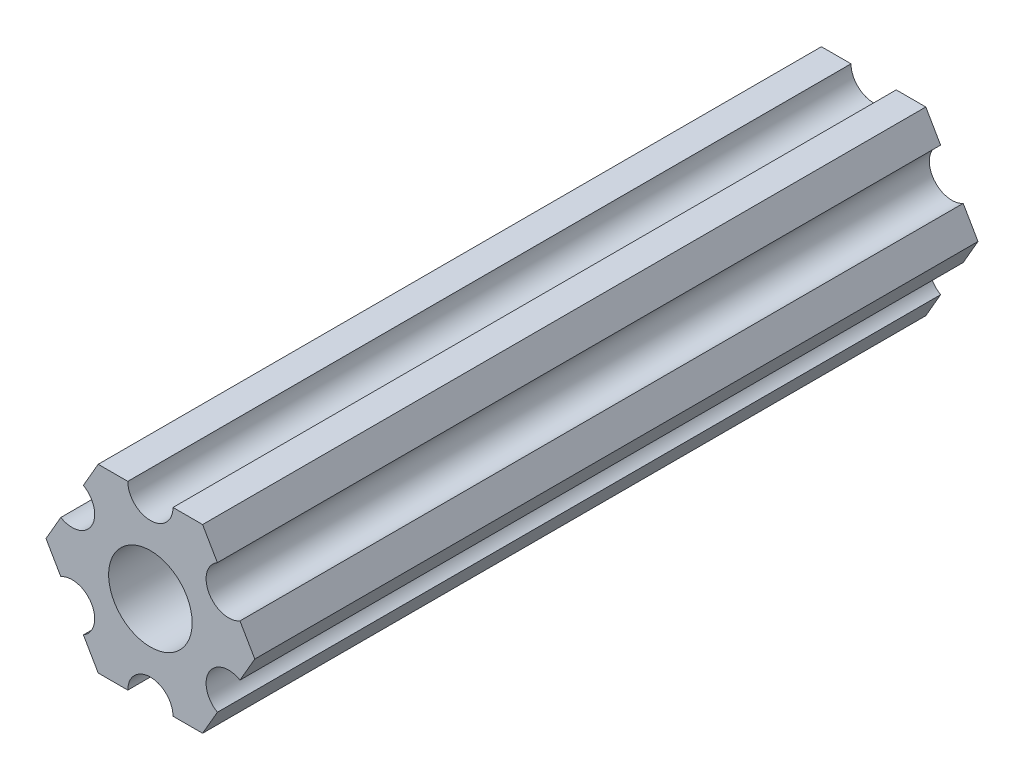
ISO-10303-21;
HEADER;
FILE_DESCRIPTION(('STEP AP214'),'2;1');
FILE_NAME('part.step','',(''),(''),'','','');
FILE_SCHEMA(('AUTOMOTIVE_DESIGN { 1 0 10303 214 1 1 1 1 }'));
ENDSEC;
DATA;
#1=APPLICATION_CONTEXT('core data for automotive mechanical design processes');
#2=APPLICATION_PROTOCOL_DEFINITION('international standard','automotive_design',2000,#1);
#3=PRODUCT_CONTEXT('',#1,'mechanical');
#4=PRODUCT('Part','Part','',(#3));
#5=PRODUCT_RELATED_PRODUCT_CATEGORY('part','',(#4));
#6=PRODUCT_DEFINITION_FORMATION('','',#4);
#7=PRODUCT_DEFINITION_CONTEXT('part definition',#1,'design');
#8=PRODUCT_DEFINITION('design','',#6,#7);
#9=PRODUCT_DEFINITION_SHAPE('','',#8);
#10=(LENGTH_UNIT() NAMED_UNIT(*) SI_UNIT(.MILLI.,.METRE.));
#11=(NAMED_UNIT(*) PLANE_ANGLE_UNIT() SI_UNIT($,.RADIAN.));
#12=(NAMED_UNIT(*) SI_UNIT($,.STERADIAN.) SOLID_ANGLE_UNIT());
#13=UNCERTAINTY_MEASURE_WITH_UNIT(LENGTH_MEASURE(1.E-05),#10,'distance_accuracy_value','');
#14=(GEOMETRIC_REPRESENTATION_CONTEXT(3) GLOBAL_UNCERTAINTY_ASSIGNED_CONTEXT((#13)) GLOBAL_UNIT_ASSIGNED_CONTEXT((#10,
#11,#12)) REPRESENTATION_CONTEXT('',''));
#15=CARTESIAN_POINT('',(0.,0.,0.));
#16=DIRECTION('',(0.,0.,1.));
#17=DIRECTION('',(1.,0.,0.));
#18=AXIS2_PLACEMENT_3D('',#15,#16,#17);
#19=CARTESIAN_POINT('',(5.49926150638083,-3.17499966684068,-50.8));
#20=DIRECTION('',(0.,0.,1.));
#21=DIRECTION('',(1.,0.,0.));
#22=AXIS2_PLACEMENT_3D('',#19,#20,#21);
#23=PLANE('',#22);
#24=CARTESIAN_POINT('',(5.49926150638083,-3.17499966684068,-50.8));
#25=DIRECTION('',(0.,0.,1.));
#26=DIRECTION('',(1.,0.,0.));
#27=AXIS2_PLACEMENT_3D('',#24,#25,#26);
#28=CIRCLE('',#27,1.58750000000001);
#29=CARTESIAN_POINT('',(6.29301142309098,-1.80018429024546,-50.8));
#30=VERTEX_POINT('',#29);
#31=CARTESIAN_POINT('',(4.70551158967068,-4.54981504343589,-50.8));
#32=VERTEX_POINT('',#31);
#33=EDGE_CURVE('E224',#30,#32,#28,.T.);
#34=ORIENTED_EDGE('',*,*,#33,.T.);
#35=DIRECTION('',(-0.499999947533953,-0.866025434075723,0.));
#36=VECTOR('',#35,1.);
#37=CARTESIAN_POINT('',(4.70551158967068,-4.54981504343589,-50.8));
#38=LINE('',#37,#36);
#39=CARTESIAN_POINT('',(3.66617452134693,-6.34999990382519,-50.8));
#40=VERTEX_POINT('',#39);
#41=EDGE_CURVE('E122',#32,#40,#38,.T.);
#42=ORIENTED_EDGE('',*,*,#41,.T.);
#43=DIRECTION('',(-1.,0.,0.));
#44=VECTOR('',#43,1.);
#45=CARTESIAN_POINT('',(3.66617452134693,-6.34999990382519,-50.8));
#46=LINE('',#45,#44);
#47=CARTESIAN_POINT('',(1.58750038469926,-6.34999990382518,-50.8));
#48=VERTEX_POINT('',#47);
#49=EDGE_CURVE('E269',#40,#48,#46,.T.);
#50=ORIENTED_EDGE('',*,*,#49,.T.);
#51=CARTESIAN_POINT('',(3.8469926204343E-07,-6.34999990382519,-50.8));
#52=DIRECTION('',(0.,0.,1.));
#53=DIRECTION('',(1.,0.,0.));
#54=AXIS2_PLACEMENT_3D('',#51,#52,#53);
#55=CIRCLE('',#54,1.5875);
#56=CARTESIAN_POINT('',(-1.58749961530074,-6.34999990382519,-50.8));
#57=VERTEX_POINT('',#56);
#58=EDGE_CURVE('E288',#48,#57,#55,.T.);
#59=ORIENTED_EDGE('',*,*,#58,.T.);
#60=DIRECTION('',(-1.,0.,0.));
#61=VECTOR('',#60,1.);
#62=CARTESIAN_POINT('',(-1.58749961530074,-6.34999990382519,-50.8));
#63=LINE('',#62,#61);
#64=CARTESIAN_POINT('',(-3.66617382465481,-6.34999990382519,-50.8));
#65=VERTEX_POINT('',#64);
#66=EDGE_CURVE('E285',#57,#65,#63,.T.);
#67=ORIENTED_EDGE('',*,*,#66,.T.);
#68=DIRECTION('',(-0.5,0.866025403784439,0.));
#69=VECTOR('',#68,1.);
#70=CARTESIAN_POINT('',(-3.66617382465481,-6.34999990382519,-50.8));
#71=LINE('',#70,#69);
#72=CARTESIAN_POINT('',(-4.70551092933191,-4.54981523233291,-50.8));
#73=VERTEX_POINT('',#72);
#74=EDGE_CURVE('E287',#65,#73,#71,.T.);
#75=ORIENTED_EDGE('',*,*,#74,.T.);
#76=CARTESIAN_POINT('',(-5.49926092933191,-3.17499990382512,-50.8));
#77=DIRECTION('',(0.,0.,1.));
#78=DIRECTION('',(1.,0.,0.));
#79=AXIS2_PLACEMENT_3D('',#76,#77,#78);
#80=CIRCLE('',#79,1.5875);
#81=CARTESIAN_POINT('',(-6.29301092933191,-1.80018457531732,-50.8));
#82=VERTEX_POINT('',#81);
#83=EDGE_CURVE('E290',#73,#82,#80,.T.);
#84=ORIENTED_EDGE('',*,*,#83,.T.);
#85=DIRECTION('',(-0.5,0.866025403784438,0.));
#86=VECTOR('',#85,1.);
#87=CARTESIAN_POINT('',(-6.29301092933191,-1.80018457531732,-50.8));
#88=LINE('',#87,#86);
#89=CARTESIAN_POINT('',(-7.33234803400895,9.61748368946088E-08,-50.8));
#90=VERTEX_POINT('',#89);
#91=EDGE_CURVE('E296',#82,#90,#88,.T.);
#92=ORIENTED_EDGE('',*,*,#91,.T.);
#93=DIRECTION('',(0.499999921300922,0.866025449221368,0.));
#94=VECTOR('',#93,1.);
#95=CARTESIAN_POINT('',(-7.33234803400895,9.61748368946088E-08,-50.8));
#96=LINE('',#95,#94);
#97=CARTESIAN_POINT('',(-6.29301117773375,1.80018471521667,-50.8));
#98=VERTEX_POINT('',#97);
#99=EDGE_CURVE('E298',#90,#98,#96,.T.);
#100=ORIENTED_EDGE('',*,*,#99,.T.);
#101=CARTESIAN_POINT('',(-5.49926130266854,3.1750001158556,-50.8));
#102=DIRECTION('',(0.,0.,1.));
#103=DIRECTION('',(1.,0.,0.));
#104=AXIS2_PLACEMENT_3D('',#101,#102,#103);
#105=CIRCLE('',#104,1.5875);
#106=CARTESIAN_POINT('',(-4.70551142760333,4.54981551649452,-50.8));
#107=VERTEX_POINT('',#106);
#108=EDGE_CURVE('E300',#98,#107,#105,.T.);
#109=ORIENTED_EDGE('',*,*,#108,.T.);
#110=DIRECTION('',(0.499999921300922,0.866025449221368,0.));
#111=VECTOR('',#110,1.);
#112=CARTESIAN_POINT('',(-4.70551142760333,4.54981551649452,-50.8));
#113=LINE('',#112,#111);
#114=CARTESIAN_POINT('',(-3.66617452134701,6.35000022210623,-50.8));
#115=VERTEX_POINT('',#114);
#116=EDGE_CURVE('E302',#107,#115,#113,.T.);
#117=ORIENTED_EDGE('',*,*,#116,.T.);
#118=DIRECTION('',(1.,0.,0.));
#119=VECTOR('',#118,1.);
#120=CARTESIAN_POINT('',(-3.66617452134701,6.35000022210623,-50.8));
#121=LINE('',#120,#119);
#122=CARTESIAN_POINT('',(-1.58750038469935,6.35000022210623,-50.8));
#123=VERTEX_POINT('',#122);
#124=EDGE_CURVE('E304',#115,#123,#121,.T.);
#125=ORIENTED_EDGE('',*,*,#124,.T.);
#126=CARTESIAN_POINT('',(-3.84699344941095E-07,6.35000022210623,-50.8));
#127=DIRECTION('',(0.,0.,1.));
#128=DIRECTION('',(1.,0.,0.));
#129=AXIS2_PLACEMENT_3D('',#126,#127,#128);
#130=CIRCLE('',#129,1.5875);
#131=CARTESIAN_POINT('',(1.58749961530066,6.35000022210623,-50.8));
#132=VERTEX_POINT('',#131);
#133=EDGE_CURVE('E306',#123,#132,#130,.T.);
#134=ORIENTED_EDGE('',*,*,#133,.T.);
#135=DIRECTION('',(1.,0.,0.));
#136=VECTOR('',#135,1.);
#137=CARTESIAN_POINT('',(1.58749961530066,6.35000022210623,-50.8));
#138=LINE('',#137,#136);
#139=CARTESIAN_POINT('',(3.66617382465472,6.35000022210622,-50.8));
#140=VERTEX_POINT('',#139);
#141=EDGE_CURVE('E308',#132,#140,#138,.T.);
#142=ORIENTED_EDGE('',*,*,#141,.T.);
#143=DIRECTION('',(0.500000052466056,-0.866025373493145,0.));
#144=VECTOR('',#143,1.);
#145=CARTESIAN_POINT('',(3.66617382465472,6.35000022210622,-50.8));
#146=LINE('',#145,#144);
#147=CARTESIAN_POINT('',(4.70551103839166,4.54981561357968,-50.8));
#148=VERTEX_POINT('',#147);
#149=EDGE_CURVE('E171',#140,#148,#146,.T.);
#150=ORIENTED_EDGE('',*,*,#149,.T.);
#151=CARTESIAN_POINT('',(5.49926112168152,3.17500033315931,-50.8));
#152=DIRECTION('',(0.,0.,1.));
#153=DIRECTION('',(1.,0.,0.));
#154=AXIS2_PLACEMENT_3D('',#151,#152,#153);
#155=CIRCLE('',#154,1.5875);
#156=CARTESIAN_POINT('',(6.29301120497139,1.80018505273895,-50.8));
#157=VERTEX_POINT('',#156);
#158=EDGE_CURVE('E165',#148,#157,#155,.T.);
#159=ORIENTED_EDGE('',*,*,#158,.T.);
#160=DIRECTION('',(0.500000052466056,-0.866025373493145,0.));
#161=VECTOR('',#160,1.);
#162=CARTESIAN_POINT('',(6.29301120497139,1.80018505273895,-50.8));
#163=LINE('',#162,#161);
#164=CARTESIAN_POINT('',(7.33234841870826,4.44212518856872E-07,-50.8));
#165=VERTEX_POINT('',#164);
#166=EDGE_CURVE('E169',#157,#165,#163,.T.);
#167=ORIENTED_EDGE('',*,*,#166,.T.);
#168=DIRECTION('',(-0.499999947533953,-0.866025434075723,0.));
#169=VECTOR('',#168,1.);
#170=CARTESIAN_POINT('',(7.33234841870826,4.44212518856872E-07,-50.8));
#171=LINE('',#170,#169);
#172=EDGE_CURVE('E49',#165,#30,#171,.T.);
#173=ORIENTED_EDGE('',*,*,#172,.T.);
#174=EDGE_LOOP('',(#34,#42,#50,#59,#67,#75,#84,#92,#100,#109,#117,#125,#134,#142,#150,#159,#167,#173));
#175=FACE_BOUND('',#174,.T.);
#176=CARTESIAN_POINT('',(0.,0.,-50.8));
#177=DIRECTION('',(0.,0.,-1.));
#178=DIRECTION('',(1.,0.,0.));
#179=AXIS2_PLACEMENT_3D('',#176,#177,#178);
#180=CIRCLE('',#179,2.9337);
#181=CARTESIAN_POINT('',(2.9337,0.,-50.8));
#182=VERTEX_POINT('',#181);
#183=EDGE_CURVE('E193',#182,#182,#180,.T.);
#184=ORIENTED_EDGE('',*,*,#183,.F.);
#185=EDGE_LOOP('',(#184));
#186=FACE_BOUND('',#185,.T.);
#187=ADVANCED_FACE('F32',(#175,#186),#23,.F.);
#188=CARTESIAN_POINT('',(5.49926150638083,-3.17499966684068,0.));
#189=DIRECTION('',(0.,0.,1.));
#190=DIRECTION('',(1.,0.,0.));
#191=AXIS2_PLACEMENT_3D('',#188,#189,#190);
#192=PLANE('',#191);
#193=CARTESIAN_POINT('',(5.49926150638083,-3.17499966684068,0.));
#194=DIRECTION('',(0.,0.,1.));
#195=DIRECTION('',(1.,0.,0.));
#196=AXIS2_PLACEMENT_3D('',#193,#194,#195);
#197=CIRCLE('',#196,1.58750000000001);
#198=CARTESIAN_POINT('',(6.29301142309098,-1.80018429024546,0.));
#199=VERTEX_POINT('',#198);
#200=CARTESIAN_POINT('',(4.70551158967068,-4.54981504343589,0.));
#201=VERTEX_POINT('',#200);
#202=EDGE_CURVE('E189',#199,#201,#197,.T.);
#203=ORIENTED_EDGE('',*,*,#202,.F.);
#204=DIRECTION('',(-0.499999947533953,-0.866025434075723,0.));
#205=VECTOR('',#204,1.);
#206=CARTESIAN_POINT('',(7.33234841870826,4.44212518856872E-07,0.));
#207=LINE('',#206,#205);
#208=CARTESIAN_POINT('',(7.33234841870826,4.44212518856872E-07,0.));
#209=VERTEX_POINT('',#208);
#210=EDGE_CURVE('E114',#209,#199,#207,.T.);
#211=ORIENTED_EDGE('',*,*,#210,.F.);
#212=DIRECTION('',(0.500000052466056,-0.866025373493145,0.));
#213=VECTOR('',#212,1.);
#214=CARTESIAN_POINT('',(6.29301120497139,1.80018505273895,0.));
#215=LINE('',#214,#213);
#216=CARTESIAN_POINT('',(6.29301120497139,1.80018505273895,0.));
#217=VERTEX_POINT('',#216);
#218=EDGE_CURVE('E108',#217,#209,#215,.T.);
#219=ORIENTED_EDGE('',*,*,#218,.F.);
#220=CARTESIAN_POINT('',(5.49926112168152,3.17500033315931,0.));
#221=DIRECTION('',(0.,0.,1.));
#222=DIRECTION('',(1.,0.,0.));
#223=AXIS2_PLACEMENT_3D('',#220,#221,#222);
#224=CIRCLE('',#223,1.5875);
#225=CARTESIAN_POINT('',(4.70551103839166,4.54981561357968,0.));
#226=VERTEX_POINT('',#225);
#227=EDGE_CURVE('E179',#226,#217,#224,.T.);
#228=ORIENTED_EDGE('',*,*,#227,.F.);
#229=DIRECTION('',(0.500000052466056,-0.866025373493145,0.));
#230=VECTOR('',#229,1.);
#231=CARTESIAN_POINT('',(3.66617382465472,6.35000022210622,0.));
#232=LINE('',#231,#230);
#233=CARTESIAN_POINT('',(3.66617382465472,6.35000022210622,0.));
#234=VERTEX_POINT('',#233);
#235=EDGE_CURVE('E219',#234,#226,#232,.T.);
#236=ORIENTED_EDGE('',*,*,#235,.F.);
#237=DIRECTION('',(1.,0.,0.));
#238=VECTOR('',#237,1.);
#239=CARTESIAN_POINT('',(1.58749961530066,6.35000022210623,0.));
#240=LINE('',#239,#238);
#241=CARTESIAN_POINT('',(1.58749961530066,6.35000022210623,0.));
#242=VERTEX_POINT('',#241);
#243=EDGE_CURVE('E217',#242,#234,#240,.T.);
#244=ORIENTED_EDGE('',*,*,#243,.F.);
#245=CARTESIAN_POINT('',(-3.84699344941095E-07,6.35000022210623,0.));
#246=DIRECTION('',(0.,0.,1.));
#247=DIRECTION('',(1.,0.,0.));
#248=AXIS2_PLACEMENT_3D('',#245,#246,#247);
#249=CIRCLE('',#248,1.5875);
#250=CARTESIAN_POINT('',(-1.58750038469935,6.35000022210623,0.));
#251=VERTEX_POINT('',#250);
#252=EDGE_CURVE('E215',#251,#242,#249,.T.);
#253=ORIENTED_EDGE('',*,*,#252,.F.);
#254=DIRECTION('',(1.,0.,0.));
#255=VECTOR('',#254,1.);
#256=CARTESIAN_POINT('',(-3.66617452134701,6.35000022210623,0.));
#257=LINE('',#256,#255);
#258=CARTESIAN_POINT('',(-3.66617452134701,6.35000022210623,0.));
#259=VERTEX_POINT('',#258);
#260=EDGE_CURVE('E213',#259,#251,#257,.T.);
#261=ORIENTED_EDGE('',*,*,#260,.F.);
#262=DIRECTION('',(0.499999921300922,0.866025449221368,0.));
#263=VECTOR('',#262,1.);
#264=CARTESIAN_POINT('',(-4.70551142760333,4.54981551649452,0.));
#265=LINE('',#264,#263);
#266=CARTESIAN_POINT('',(-4.70551142760333,4.54981551649452,0.));
#267=VERTEX_POINT('',#266);
#268=EDGE_CURVE('E211',#267,#259,#265,.T.);
#269=ORIENTED_EDGE('',*,*,#268,.F.);
#270=CARTESIAN_POINT('',(-5.49926130266854,3.1750001158556,0.));
#271=DIRECTION('',(0.,0.,1.));
#272=DIRECTION('',(1.,0.,0.));
#273=AXIS2_PLACEMENT_3D('',#270,#271,#272);
#274=CIRCLE('',#273,1.5875);
#275=CARTESIAN_POINT('',(-6.29301117773375,1.80018471521667,0.));
#276=VERTEX_POINT('',#275);
#277=EDGE_CURVE('E209',#276,#267,#274,.T.);
#278=ORIENTED_EDGE('',*,*,#277,.F.);
#279=DIRECTION('',(0.499999921300922,0.866025449221368,0.));
#280=VECTOR('',#279,1.);
#281=CARTESIAN_POINT('',(-7.33234803400895,9.61748368946088E-08,0.));
#282=LINE('',#281,#280);
#283=CARTESIAN_POINT('',(-7.33234803400895,9.61748368946088E-08,0.));
#284=VERTEX_POINT('',#283);
#285=EDGE_CURVE('E207',#284,#276,#282,.T.);
#286=ORIENTED_EDGE('',*,*,#285,.F.);
#287=DIRECTION('',(-0.5,0.866025403784438,0.));
#288=VECTOR('',#287,1.);
#289=CARTESIAN_POINT('',(-6.29301092933191,-1.80018457531732,0.));
#290=LINE('',#289,#288);
#291=CARTESIAN_POINT('',(-6.29301092933191,-1.80018457531732,0.));
#292=VERTEX_POINT('',#291);
#293=EDGE_CURVE('E205',#292,#284,#290,.T.);
#294=ORIENTED_EDGE('',*,*,#293,.F.);
#295=CARTESIAN_POINT('',(-5.49926092933191,-3.17499990382512,0.));
#296=DIRECTION('',(0.,0.,1.));
#297=DIRECTION('',(1.,0.,0.));
#298=AXIS2_PLACEMENT_3D('',#295,#296,#297);
#299=CIRCLE('',#298,1.5875);
#300=CARTESIAN_POINT('',(-4.70551092933191,-4.54981523233291,0.));
#301=VERTEX_POINT('',#300);
#302=EDGE_CURVE('E203',#301,#292,#299,.T.);
#303=ORIENTED_EDGE('',*,*,#302,.F.);
#304=DIRECTION('',(-0.5,0.866025403784439,0.));
#305=VECTOR('',#304,1.);
#306=CARTESIAN_POINT('',(-3.66617382465481,-6.34999990382519,0.));
#307=LINE('',#306,#305);
#308=CARTESIAN_POINT('',(-3.66617382465481,-6.34999990382519,0.));
#309=VERTEX_POINT('',#308);
#310=EDGE_CURVE('E201',#309,#301,#307,.T.);
#311=ORIENTED_EDGE('',*,*,#310,.F.);
#312=DIRECTION('',(-1.,0.,0.));
#313=VECTOR('',#312,1.);
#314=CARTESIAN_POINT('',(-1.58749961530074,-6.34999990382519,0.));
#315=LINE('',#314,#313);
#316=CARTESIAN_POINT('',(-1.58749961530074,-6.34999990382519,0.));
#317=VERTEX_POINT('',#316);
#318=EDGE_CURVE('E199',#317,#309,#315,.T.);
#319=ORIENTED_EDGE('',*,*,#318,.F.);
#320=CARTESIAN_POINT('',(3.8469926204343E-07,-6.34999990382519,0.));
#321=DIRECTION('',(0.,0.,1.));
#322=DIRECTION('',(1.,0.,0.));
#323=AXIS2_PLACEMENT_3D('',#320,#321,#322);
#324=CIRCLE('',#323,1.5875);
#325=CARTESIAN_POINT('',(1.58750038469926,-6.34999990382518,0.));
#326=VERTEX_POINT('',#325);
#327=EDGE_CURVE('E197',#326,#317,#324,.T.);
#328=ORIENTED_EDGE('',*,*,#327,.F.);
#329=DIRECTION('',(-1.,0.,0.));
#330=VECTOR('',#329,1.);
#331=CARTESIAN_POINT('',(3.66617452134693,-6.34999990382519,0.));
#332=LINE('',#331,#330);
#333=CARTESIAN_POINT('',(3.66617452134693,-6.34999990382519,0.));
#334=VERTEX_POINT('',#333);
#335=EDGE_CURVE('E195',#334,#326,#332,.T.);
#336=ORIENTED_EDGE('',*,*,#335,.F.);
#337=DIRECTION('',(-0.499999947533953,-0.866025434075723,0.));
#338=VECTOR('',#337,1.);
#339=CARTESIAN_POINT('',(4.70551158967068,-4.54981504343589,0.));
#340=LINE('',#339,#338);
#341=EDGE_CURVE('E192',#201,#334,#340,.T.);
#342=ORIENTED_EDGE('',*,*,#341,.F.);
#343=EDGE_LOOP('',(#203,#211,#219,#228,#236,#244,#253,#261,#269,#278,#286,#294,#303,#311,#319,
#328,#336,#342));
#344=FACE_BOUND('',#343,.T.);
#345=CARTESIAN_POINT('',(0.,0.,0.));
#346=DIRECTION('',(0.,0.,-1.));
#347=DIRECTION('',(1.,0.,0.));
#348=AXIS2_PLACEMENT_3D('',#345,#346,#347);
#349=CIRCLE('',#348,2.9337);
#350=CARTESIAN_POINT('',(2.9337,0.,0.));
#351=VERTEX_POINT('',#350);
#352=EDGE_CURVE('E533',#351,#351,#349,.T.);
#353=ORIENTED_EDGE('',*,*,#352,.T.);
#354=EDGE_LOOP('',(#353));
#355=FACE_BOUND('',#354,.T.);
#356=ADVANCED_FACE('F273',(#344,#355),#192,.T.);
#357=CARTESIAN_POINT('',(5.49926150638083,-3.17499966684068,-50.8));
#358=DIRECTION('',(0.,0.,1.));
#359=DIRECTION('',(1.,0.,0.));
#360=AXIS2_PLACEMENT_3D('',#357,#358,#359);
#361=CYLINDRICAL_SURFACE('',#360,1.58750000000001);
#362=ORIENTED_EDGE('',*,*,#202,.T.);
#363=DIRECTION('',(0.,0.,1.));
#364=VECTOR('',#363,1.);
#365=CARTESIAN_POINT('',(4.70551158967068,-4.54981504343589,-50.8));
#366=LINE('',#365,#364);
#367=EDGE_CURVE('E11',#32,#201,#366,.T.);
#368=ORIENTED_EDGE('',*,*,#367,.F.);
#369=ORIENTED_EDGE('',*,*,#33,.F.);
#370=DIRECTION('',(0.,0.,1.));
#371=VECTOR('',#370,1.);
#372=CARTESIAN_POINT('',(6.29301142309098,-1.80018429024546,-50.8));
#373=LINE('',#372,#371);
#374=EDGE_CURVE('E185',#30,#199,#373,.T.);
#375=ORIENTED_EDGE('',*,*,#374,.T.);
#376=EDGE_LOOP('',(#362,#368,#369,#375));
#377=FACE_BOUND('',#376,.T.);
#378=ADVANCED_FACE('F34',(#377),#361,.F.);
#379=CARTESIAN_POINT('',(4.70551158967068,-4.54981504343589,-50.8));
#380=DIRECTION('',(-0.866025434075723,0.499999947533953,0.));
#381=DIRECTION('',(-0.499999947533953,-0.866025434075723,0.));
#382=AXIS2_PLACEMENT_3D('',#379,#380,#381);
#383=PLANE('',#382);
#384=ORIENTED_EDGE('',*,*,#341,.T.);
#385=DIRECTION('',(0.,0.,1.));
#386=VECTOR('',#385,1.);
#387=CARTESIAN_POINT('',(3.66617452134693,-6.34999990382519,-50.8));
#388=LINE('',#387,#386);
#389=EDGE_CURVE('E41',#40,#334,#388,.T.);
#390=ORIENTED_EDGE('',*,*,#389,.F.);
#391=ORIENTED_EDGE('',*,*,#41,.F.);
#392=ORIENTED_EDGE('',*,*,#367,.T.);
#393=EDGE_LOOP('',(#384,#390,#391,#392));
#394=FACE_BOUND('',#393,.T.);
#395=ADVANCED_FACE('F342',(#394),#383,.F.);
#396=CARTESIAN_POINT('',(3.66617452134693,-6.34999990382519,-50.8));
#397=DIRECTION('',(0.,1.,0.));
#398=DIRECTION('',(-1.,0.,0.));
#399=AXIS2_PLACEMENT_3D('',#396,#397,#398);
#400=PLANE('',#399);
#401=ORIENTED_EDGE('',*,*,#335,.T.);
#402=DIRECTION('',(0.,0.,1.));
#403=VECTOR('',#402,1.);
#404=CARTESIAN_POINT('',(1.58750038469926,-6.34999990382518,-50.8));
#405=LINE('',#404,#403);
#406=EDGE_CURVE('E261',#48,#326,#405,.T.);
#407=ORIENTED_EDGE('',*,*,#406,.F.);
#408=ORIENTED_EDGE('',*,*,#49,.F.);
#409=ORIENTED_EDGE('',*,*,#389,.T.);
#410=EDGE_LOOP('',(#401,#407,#408,#409));
#411=FACE_BOUND('',#410,.T.);
#412=ADVANCED_FACE('F267',(#411),#400,.F.);
#413=CARTESIAN_POINT('',(3.8469926204343E-07,-6.34999990382519,-50.8));
#414=DIRECTION('',(0.,0.,1.));
#415=DIRECTION('',(1.,0.,0.));
#416=AXIS2_PLACEMENT_3D('',#413,#414,#415);
#417=CYLINDRICAL_SURFACE('',#416,1.5875);
#418=ORIENTED_EDGE('',*,*,#327,.T.);
#419=DIRECTION('',(0.,0.,1.));
#420=VECTOR('',#419,1.);
#421=CARTESIAN_POINT('',(-1.58749961530074,-6.34999990382519,-50.8));
#422=LINE('',#421,#420);
#423=EDGE_CURVE('E258',#57,#317,#422,.T.);
#424=ORIENTED_EDGE('',*,*,#423,.F.);
#425=ORIENTED_EDGE('',*,*,#58,.F.);
#426=ORIENTED_EDGE('',*,*,#406,.T.);
#427=EDGE_LOOP('',(#418,#424,#425,#426));
#428=FACE_BOUND('',#427,.T.);
#429=ADVANCED_FACE('F279',(#428),#417,.F.);
#430=CARTESIAN_POINT('',(-1.58749961530074,-6.34999990382519,-50.8));
#431=DIRECTION('',(0.,1.,0.));
#432=DIRECTION('',(-1.,0.,0.));
#433=AXIS2_PLACEMENT_3D('',#430,#431,#432);
#434=PLANE('',#433);
#435=ORIENTED_EDGE('',*,*,#318,.T.);
#436=DIRECTION('',(0.,0.,1.));
#437=VECTOR('',#436,1.);
#438=CARTESIAN_POINT('',(-3.66617382465481,-6.34999990382519,-50.8));
#439=LINE('',#438,#437);
#440=EDGE_CURVE('E255',#65,#309,#439,.T.);
#441=ORIENTED_EDGE('',*,*,#440,.F.);
#442=ORIENTED_EDGE('',*,*,#66,.F.);
#443=ORIENTED_EDGE('',*,*,#423,.T.);
#444=EDGE_LOOP('',(#435,#441,#442,#443));
#445=FACE_BOUND('',#444,.T.);
#446=ADVANCED_FACE('F283',(#445),#434,.F.);
#447=CARTESIAN_POINT('',(-3.66617382465481,-6.34999990382519,-50.8));
#448=DIRECTION('',(0.866025403784438,0.5,0.));
#449=DIRECTION('',(-0.5,0.866025403784439,0.));
#450=AXIS2_PLACEMENT_3D('',#447,#448,#449);
#451=PLANE('',#450);
#452=ORIENTED_EDGE('',*,*,#310,.T.);
#453=DIRECTION('',(0.,0.,1.));
#454=VECTOR('',#453,1.);
#455=CARTESIAN_POINT('',(-4.70551092933191,-4.54981523233291,-50.8));
#456=LINE('',#455,#454);
#457=EDGE_CURVE('E252',#73,#301,#456,.T.);
#458=ORIENTED_EDGE('',*,*,#457,.F.);
#459=ORIENTED_EDGE('',*,*,#74,.F.);
#460=ORIENTED_EDGE('',*,*,#440,.T.);
#461=EDGE_LOOP('',(#452,#458,#459,#460));
#462=FACE_BOUND('',#461,.T.);
#463=ADVANCED_FACE('F355',(#462),#451,.F.);
#464=CARTESIAN_POINT('',(-5.49926092933191,-3.17499990382512,-50.8));
#465=DIRECTION('',(0.,0.,1.));
#466=DIRECTION('',(1.,0.,0.));
#467=AXIS2_PLACEMENT_3D('',#464,#465,#466);
#468=CYLINDRICAL_SURFACE('',#467,1.5875);
#469=ORIENTED_EDGE('',*,*,#302,.T.);
#470=DIRECTION('',(0.,0.,1.));
#471=VECTOR('',#470,1.);
#472=CARTESIAN_POINT('',(-6.29301092933191,-1.80018457531732,-50.8));
#473=LINE('',#472,#471);
#474=EDGE_CURVE('E249',#82,#292,#473,.T.);
#475=ORIENTED_EDGE('',*,*,#474,.F.);
#476=ORIENTED_EDGE('',*,*,#83,.F.);
#477=ORIENTED_EDGE('',*,*,#457,.T.);
#478=EDGE_LOOP('',(#469,#475,#476,#477));
#479=FACE_BOUND('',#478,.T.);
#480=ADVANCED_FACE('F358',(#479),#468,.F.);
#481=CARTESIAN_POINT('',(-6.29301092933191,-1.80018457531732,-50.8));
#482=DIRECTION('',(0.866025403784438,0.5,0.));
#483=DIRECTION('',(-0.5,0.866025403784438,0.));
#484=AXIS2_PLACEMENT_3D('',#481,#482,#483);
#485=PLANE('',#484);
#486=ORIENTED_EDGE('',*,*,#293,.T.);
#487=DIRECTION('',(0.,0.,1.));
#488=VECTOR('',#487,1.);
#489=CARTESIAN_POINT('',(-7.33234803400895,9.61748368946088E-08,-50.8));
#490=LINE('',#489,#488);
#491=EDGE_CURVE('E246',#90,#284,#490,.T.);
#492=ORIENTED_EDGE('',*,*,#491,.F.);
#493=ORIENTED_EDGE('',*,*,#91,.F.);
#494=ORIENTED_EDGE('',*,*,#474,.T.);
#495=EDGE_LOOP('',(#486,#492,#493,#494));
#496=FACE_BOUND('',#495,.T.);
#497=ADVANCED_FACE('F362',(#496),#485,.F.);
#498=CARTESIAN_POINT('',(-7.33234803400895,9.61748368946088E-08,-50.8));
#499=DIRECTION('',(0.866025449221368,-0.499999921300922,0.));
#500=DIRECTION('',(0.499999921300922,0.866025449221368,0.));
#501=AXIS2_PLACEMENT_3D('',#498,#499,#500);
#502=PLANE('',#501);
#503=ORIENTED_EDGE('',*,*,#285,.T.);
#504=DIRECTION('',(0.,0.,1.));
#505=VECTOR('',#504,1.);
#506=CARTESIAN_POINT('',(-6.29301117773375,1.80018471521667,-50.8));
#507=LINE('',#506,#505);
#508=EDGE_CURVE('E243',#98,#276,#507,.T.);
#509=ORIENTED_EDGE('',*,*,#508,.F.);
#510=ORIENTED_EDGE('',*,*,#99,.F.);
#511=ORIENTED_EDGE('',*,*,#491,.T.);
#512=EDGE_LOOP('',(#503,#509,#510,#511));
#513=FACE_BOUND('',#512,.T.);
#514=ADVANCED_FACE('F366',(#513),#502,.F.);
#515=CARTESIAN_POINT('',(-5.49926130266854,3.1750001158556,-50.8));
#516=DIRECTION('',(0.,0.,1.));
#517=DIRECTION('',(1.,0.,0.));
#518=AXIS2_PLACEMENT_3D('',#515,#516,#517);
#519=CYLINDRICAL_SURFACE('',#518,1.5875);
#520=ORIENTED_EDGE('',*,*,#277,.T.);
#521=DIRECTION('',(0.,0.,1.));
#522=VECTOR('',#521,1.);
#523=CARTESIAN_POINT('',(-4.70551142760333,4.54981551649452,-50.8));
#524=LINE('',#523,#522);
#525=EDGE_CURVE('E240',#107,#267,#524,.T.);
#526=ORIENTED_EDGE('',*,*,#525,.F.);
#527=ORIENTED_EDGE('',*,*,#108,.F.);
#528=ORIENTED_EDGE('',*,*,#508,.T.);
#529=EDGE_LOOP('',(#520,#526,#527,#528));
#530=FACE_BOUND('',#529,.T.);
#531=ADVANCED_FACE('F370',(#530),#519,.F.);
#532=CARTESIAN_POINT('',(-4.70551142760333,4.54981551649452,-50.8));
#533=DIRECTION('',(0.866025449221368,-0.499999921300922,0.));
#534=DIRECTION('',(0.499999921300922,0.866025449221368,0.));
#535=AXIS2_PLACEMENT_3D('',#532,#533,#534);
#536=PLANE('',#535);
#537=ORIENTED_EDGE('',*,*,#268,.T.);
#538=DIRECTION('',(0.,0.,1.));
#539=VECTOR('',#538,1.);
#540=CARTESIAN_POINT('',(-3.66617452134701,6.35000022210623,-50.8));
#541=LINE('',#540,#539);
#542=EDGE_CURVE('E237',#115,#259,#541,.T.);
#543=ORIENTED_EDGE('',*,*,#542,.F.);
#544=ORIENTED_EDGE('',*,*,#116,.F.);
#545=ORIENTED_EDGE('',*,*,#525,.T.);
#546=EDGE_LOOP('',(#537,#543,#544,#545));
#547=FACE_BOUND('',#546,.T.);
#548=ADVANCED_FACE('F374',(#547),#536,.F.);
#549=CARTESIAN_POINT('',(-3.66617452134701,6.35000022210623,-50.8));
#550=DIRECTION('',(0.,-1.,0.));
#551=DIRECTION('',(0.,0.,-1.));
#552=AXIS2_PLACEMENT_3D('',#549,#550,#551);
#553=PLANE('',#552);
#554=ORIENTED_EDGE('',*,*,#260,.T.);
#555=DIRECTION('',(0.,0.,1.));
#556=VECTOR('',#555,1.);
#557=CARTESIAN_POINT('',(-1.58750038469935,6.35000022210623,-50.8));
#558=LINE('',#557,#556);
#559=EDGE_CURVE('E234',#123,#251,#558,.T.);
#560=ORIENTED_EDGE('',*,*,#559,.F.);
#561=ORIENTED_EDGE('',*,*,#124,.F.);
#562=ORIENTED_EDGE('',*,*,#542,.T.);
#563=EDGE_LOOP('',(#554,#560,#561,#562));
#564=FACE_BOUND('',#563,.T.);
#565=ADVANCED_FACE('F378',(#564),#553,.F.);
#566=CARTESIAN_POINT('',(-3.84699344941095E-07,6.35000022210623,-50.8));
#567=DIRECTION('',(0.,0.,1.));
#568=DIRECTION('',(1.,0.,0.));
#569=AXIS2_PLACEMENT_3D('',#566,#567,#568);
#570=CYLINDRICAL_SURFACE('',#569,1.5875);
#571=ORIENTED_EDGE('',*,*,#252,.T.);
#572=DIRECTION('',(0.,0.,1.));
#573=VECTOR('',#572,1.);
#574=CARTESIAN_POINT('',(1.58749961530066,6.35000022210623,-50.8));
#575=LINE('',#574,#573);
#576=EDGE_CURVE('E231',#132,#242,#575,.T.);
#577=ORIENTED_EDGE('',*,*,#576,.F.);
#578=ORIENTED_EDGE('',*,*,#133,.F.);
#579=ORIENTED_EDGE('',*,*,#559,.T.);
#580=EDGE_LOOP('',(#571,#577,#578,#579));
#581=FACE_BOUND('',#580,.T.);
#582=ADVANCED_FACE('F382',(#581),#570,.F.);
#583=CARTESIAN_POINT('',(1.58749961530066,6.35000022210623,-50.8));
#584=DIRECTION('',(0.,-1.,0.));
#585=DIRECTION('',(1.,0.,0.));
#586=AXIS2_PLACEMENT_3D('',#583,#584,#585);
#587=PLANE('',#586);
#588=ORIENTED_EDGE('',*,*,#243,.T.);
#589=DIRECTION('',(0.,0.,1.));
#590=VECTOR('',#589,1.);
#591=CARTESIAN_POINT('',(3.66617382465472,6.35000022210622,-50.8));
#592=LINE('',#591,#590);
#593=EDGE_CURVE('E228',#140,#234,#592,.T.);
#594=ORIENTED_EDGE('',*,*,#593,.F.);
#595=ORIENTED_EDGE('',*,*,#141,.F.);
#596=ORIENTED_EDGE('',*,*,#576,.T.);
#597=EDGE_LOOP('',(#588,#594,#595,#596));
#598=FACE_BOUND('',#597,.T.);
#599=ADVANCED_FACE('F314',(#598),#587,.F.);
#600=CARTESIAN_POINT('',(3.66617382465472,6.35000022210622,-50.8));
#601=DIRECTION('',(-0.866025373493145,-0.500000052466056,0.));
#602=DIRECTION('',(0.500000052466056,-0.866025373493145,0.));
#603=AXIS2_PLACEMENT_3D('',#600,#601,#602);
#604=PLANE('',#603);
#605=ORIENTED_EDGE('',*,*,#235,.T.);
#606=DIRECTION('',(0.,0.,1.));
#607=VECTOR('',#606,1.);
#608=CARTESIAN_POINT('',(4.70551103839166,4.54981561357968,-50.8));
#609=LINE('',#608,#607);
#610=EDGE_CURVE('E180',#148,#226,#609,.T.);
#611=ORIENTED_EDGE('',*,*,#610,.F.);
#612=ORIENTED_EDGE('',*,*,#149,.F.);
#613=ORIENTED_EDGE('',*,*,#593,.T.);
#614=EDGE_LOOP('',(#605,#611,#612,#613));
#615=FACE_BOUND('',#614,.T.);
#616=ADVANCED_FACE('F318',(#615),#604,.F.);
#617=CARTESIAN_POINT('',(5.49926112168152,3.17500033315931,-50.8));
#618=DIRECTION('',(0.,0.,1.));
#619=DIRECTION('',(1.,0.,0.));
#620=AXIS2_PLACEMENT_3D('',#617,#618,#619);
#621=CYLINDRICAL_SURFACE('',#620,1.5875);
#622=ORIENTED_EDGE('',*,*,#227,.T.);
#623=DIRECTION('',(0.,0.,1.));
#624=VECTOR('',#623,1.);
#625=CARTESIAN_POINT('',(6.29301120497139,1.80018505273895,-50.8));
#626=LINE('',#625,#624);
#627=EDGE_CURVE('E176',#157,#217,#626,.T.);
#628=ORIENTED_EDGE('',*,*,#627,.F.);
#629=ORIENTED_EDGE('',*,*,#158,.F.);
#630=ORIENTED_EDGE('',*,*,#610,.T.);
#631=EDGE_LOOP('',(#622,#628,#629,#630));
#632=FACE_BOUND('',#631,.T.);
#633=ADVANCED_FACE('F177',(#632),#621,.F.);
#634=CARTESIAN_POINT('',(6.29301120497139,1.80018505273895,-50.8));
#635=DIRECTION('',(-0.866025373493145,-0.500000052466056,0.));
#636=DIRECTION('',(0.500000052466056,-0.866025373493145,0.));
#637=AXIS2_PLACEMENT_3D('',#634,#635,#636);
#638=PLANE('',#637);
#639=ORIENTED_EDGE('',*,*,#218,.T.);
#640=DIRECTION('',(0.,0.,1.));
#641=VECTOR('',#640,1.);
#642=CARTESIAN_POINT('',(7.33234841870826,4.44212518856872E-07,-50.8));
#643=LINE('',#642,#641);
#644=EDGE_CURVE('E181',#165,#209,#643,.T.);
#645=ORIENTED_EDGE('',*,*,#644,.F.);
#646=ORIENTED_EDGE('',*,*,#166,.F.);
#647=ORIENTED_EDGE('',*,*,#627,.T.);
#648=EDGE_LOOP('',(#639,#645,#646,#647));
#649=FACE_BOUND('',#648,.T.);
#650=ADVANCED_FACE('F183',(#649),#638,.F.);
#651=CARTESIAN_POINT('',(7.33234841870826,4.44212518856872E-07,-50.8));
#652=DIRECTION('',(-0.866025434075723,0.499999947533953,0.));
#653=DIRECTION('',(-0.499999947533953,-0.866025434075723,0.));
#654=AXIS2_PLACEMENT_3D('',#651,#652,#653);
#655=PLANE('',#654);
#656=ORIENTED_EDGE('',*,*,#210,.T.);
#657=ORIENTED_EDGE('',*,*,#374,.F.);
#658=ORIENTED_EDGE('',*,*,#172,.F.);
#659=ORIENTED_EDGE('',*,*,#644,.T.);
#660=EDGE_LOOP('',(#656,#657,#658,#659));
#661=FACE_BOUND('',#660,.T.);
#662=ADVANCED_FACE('F322',(#661),#655,.F.);
#663=CARTESIAN_POINT('',(0.,0.,-50.8));
#664=DIRECTION('',(0.,0.,1.));
#665=DIRECTION('',(1.,0.,0.));
#666=AXIS2_PLACEMENT_3D('',#663,#664,#665);
#667=CYLINDRICAL_SURFACE('',#666,2.9337);
#668=ORIENTED_EDGE('',*,*,#183,.T.);
#669=EDGE_LOOP('',(#668));
#670=FACE_BOUND('',#669,.T.);
#671=ORIENTED_EDGE('',*,*,#352,.F.);
#672=EDGE_LOOP('',(#671));
#673=FACE_BOUND('',#672,.T.);
#674=ADVANCED_FACE('F324',(#670,#673),#667,.F.);
#675=CLOSED_SHELL('',(#187,#356,#378,#395,#412,#429,#446,#463,#480,#497,#514,#531,#548,#565,
#582,#599,#616,#633,#650,#662,#674));
#676=MANIFOLD_SOLID_BREP('B2',#675);
#677=ADVANCED_BREP_SHAPE_REPRESENTATION('',(#18,#676),#14);
#678=SHAPE_DEFINITION_REPRESENTATION(#9,#677);
ENDSEC;
END-ISO-10303-21;
